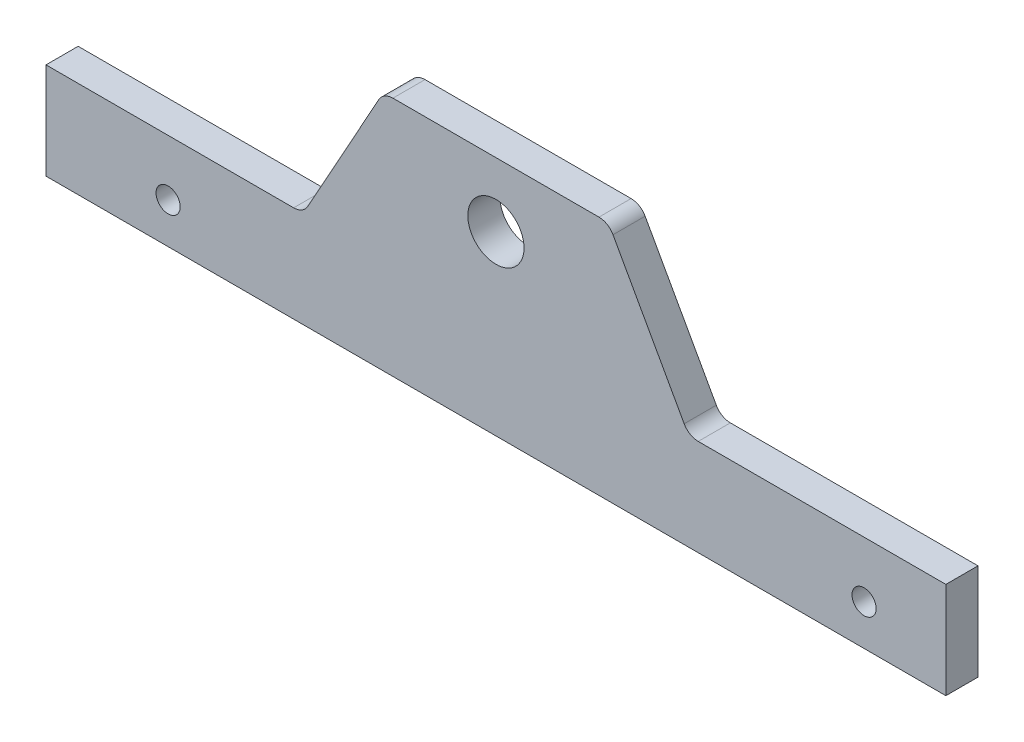
ISO-10303-21;
HEADER;
FILE_DESCRIPTION(('STEP AP214'),'2;1');
FILE_NAME('part.step','',(''),(''),'','','');
FILE_SCHEMA(('AUTOMOTIVE_DESIGN { 1 0 10303 214 1 1 1 1 }'));
ENDSEC;
DATA;
#1=APPLICATION_CONTEXT('core data for automotive mechanical design processes');
#2=APPLICATION_PROTOCOL_DEFINITION('international standard','automotive_design',2000,#1);
#3=PRODUCT_CONTEXT('',#1,'mechanical');
#4=PRODUCT('Part','Part','',(#3));
#5=PRODUCT_RELATED_PRODUCT_CATEGORY('part','',(#4));
#6=PRODUCT_DEFINITION_FORMATION('','',#4);
#7=PRODUCT_DEFINITION_CONTEXT('part definition',#1,'design');
#8=PRODUCT_DEFINITION('design','',#6,#7);
#9=PRODUCT_DEFINITION_SHAPE('','',#8);
#10=(LENGTH_UNIT() NAMED_UNIT(*) SI_UNIT(.MILLI.,.METRE.));
#11=(NAMED_UNIT(*) PLANE_ANGLE_UNIT() SI_UNIT($,.RADIAN.));
#12=(NAMED_UNIT(*) SI_UNIT($,.STERADIAN.) SOLID_ANGLE_UNIT());
#13=UNCERTAINTY_MEASURE_WITH_UNIT(LENGTH_MEASURE(1.E-05),#10,'distance_accuracy_value','');
#14=(GEOMETRIC_REPRESENTATION_CONTEXT(3) GLOBAL_UNCERTAINTY_ASSIGNED_CONTEXT((#13)) GLOBAL_UNIT_ASSIGNED_CONTEXT((#10,
#11,#12)) REPRESENTATION_CONTEXT('',''));
#15=CARTESIAN_POINT('',(0.,0.,0.));
#16=DIRECTION('',(0.,0.,1.));
#17=DIRECTION('',(1.,0.,0.));
#18=AXIS2_PLACEMENT_3D('',#15,#16,#17);
#19=CARTESIAN_POINT('',(39.9681806330704,3.17500000000001,3.175));
#20=DIRECTION('',(0.,0.,1.));
#21=DIRECTION('',(1.,0.,0.));
#22=AXIS2_PLACEMENT_3D('',#19,#20,#21);
#23=PLANE('',#22);
#24=CARTESIAN_POINT('',(72.7456,-11.049,3.175));
#25=DIRECTION('',(0.,0.,1.));
#26=DIRECTION('',(1.,0.,0.));
#27=AXIS2_PLACEMENT_3D('',#24,#25,#26);
#28=CIRCLE('',#27,2.38760000000001);
#29=CARTESIAN_POINT('',(75.1332,-11.049,3.175));
#30=VERTEX_POINT('',#29);
#31=EDGE_CURVE('E279',#30,#30,#28,.T.);
#32=ORIENTED_EDGE('',*,*,#31,.F.);
#33=EDGE_LOOP('',(#32));
#34=FACE_BOUND('',#33,.T.);
#35=CARTESIAN_POINT('',(-64.77,-11.049,3.175));
#36=DIRECTION('',(0.,0.,1.));
#37=DIRECTION('',(1.,0.,0.));
#38=AXIS2_PLACEMENT_3D('',#35,#36,#37);
#39=CIRCLE('',#38,2.38760000000001);
#40=CARTESIAN_POINT('',(-62.3824,-11.049,3.175));
#41=VERTEX_POINT('',#40);
#42=EDGE_CURVE('E281',#41,#41,#39,.T.);
#43=ORIENTED_EDGE('',*,*,#42,.F.);
#44=EDGE_LOOP('',(#43));
#45=FACE_BOUND('',#44,.T.);
#46=DIRECTION('',(0.,-1.,0.));
#47=VECTOR('',#46,1.);
#48=CARTESIAN_POINT('',(-88.9,0.,3.175));
#49=LINE('',#48,#47);
#50=CARTESIAN_POINT('',(-88.9,0.,3.175));
#51=VERTEX_POINT('',#50);
#52=CARTESIAN_POINT('',(-88.9,-19.05,3.175));
#53=VERTEX_POINT('',#52);
#54=EDGE_CURVE('E175',#51,#53,#49,.T.);
#55=ORIENTED_EDGE('',*,*,#54,.T.);
#56=DIRECTION('',(1.,0.,0.));
#57=VECTOR('',#56,1.);
#58=CARTESIAN_POINT('',(-88.9,-19.05,3.175));
#59=LINE('',#58,#57);
#60=CARTESIAN_POINT('',(88.9,-19.05,3.175));
#61=VERTEX_POINT('',#60);
#62=EDGE_CURVE('E103',#53,#61,#59,.T.);
#63=ORIENTED_EDGE('',*,*,#62,.T.);
#64=DIRECTION('',(0.,1.,0.));
#65=VECTOR('',#64,1.);
#66=CARTESIAN_POINT('',(88.9,-19.05,3.175));
#67=LINE('',#66,#65);
#68=CARTESIAN_POINT('',(88.9,0.,3.175));
#69=VERTEX_POINT('',#68);
#70=EDGE_CURVE('E202',#61,#69,#67,.T.);
#71=ORIENTED_EDGE('',*,*,#70,.T.);
#72=DIRECTION('',(-1.,0.,0.));
#73=VECTOR('',#72,1.);
#74=CARTESIAN_POINT('',(88.9,0.,3.175));
#75=LINE('',#74,#73);
#76=CARTESIAN_POINT('',(39.9681806330704,0.,3.175));
#77=VERTEX_POINT('',#76);
#78=EDGE_CURVE('E221',#69,#77,#75,.T.);
#79=ORIENTED_EDGE('',*,*,#78,.T.);
#80=CARTESIAN_POINT('',(39.9681806330704,3.17500000000001,3.175));
#81=DIRECTION('',(0.,0.,-1.));
#82=DIRECTION('',(1.,0.,0.));
#83=AXIS2_PLACEMENT_3D('',#80,#81,#82);
#84=CIRCLE('',#83,3.175);
#85=CARTESIAN_POINT('',(37.1927312813845,1.63308369350787,3.175));
#86=VERTEX_POINT('',#85);
#87=EDGE_CURVE('E218',#77,#86,#84,.T.);
#88=ORIENTED_EDGE('',*,*,#87,.T.);
#89=DIRECTION('',(-0.485642931178632,0.874157276121538,0.));
#90=VECTOR('',#89,1.);
#91=CARTESIAN_POINT('',(37.1927312813845,1.63308369350787,3.175));
#92=LINE('',#91,#90);
#93=CARTESIAN_POINT('',(23.1322687186155,26.9419163064921,3.175));
#94=VERTEX_POINT('',#93);
#95=EDGE_CURVE('E220',#86,#94,#92,.T.);
#96=ORIENTED_EDGE('',*,*,#95,.T.);
#97=CARTESIAN_POINT('',(20.3568193669296,25.4,3.175));
#98=DIRECTION('',(0.,0.,1.));
#99=DIRECTION('',(1.,0.,0.));
#100=AXIS2_PLACEMENT_3D('',#97,#98,#99);
#101=CIRCLE('',#100,3.175);
#102=CARTESIAN_POINT('',(20.3568193669296,28.575,3.175));
#103=VERTEX_POINT('',#102);
#104=EDGE_CURVE('E223',#94,#103,#101,.T.);
#105=ORIENTED_EDGE('',*,*,#104,.T.);
#106=DIRECTION('',(-1.,0.,0.));
#107=VECTOR('',#106,1.);
#108=CARTESIAN_POINT('',(-20.3568193669296,28.575,3.175));
#109=LINE('',#108,#107);
#110=CARTESIAN_POINT('',(-20.3568193669296,28.575,3.175));
#111=VERTEX_POINT('',#110);
#112=EDGE_CURVE('E229',#103,#111,#109,.T.);
#113=ORIENTED_EDGE('',*,*,#112,.T.);
#114=CARTESIAN_POINT('',(-20.3568193669296,25.4,3.175));
#115=DIRECTION('',(0.,0.,1.));
#116=DIRECTION('',(-1.,0.,0.));
#117=AXIS2_PLACEMENT_3D('',#114,#115,#116);
#118=CIRCLE('',#117,3.175);
#119=CARTESIAN_POINT('',(-23.1322687186155,26.9419163064921,3.175));
#120=VERTEX_POINT('',#119);
#121=EDGE_CURVE('E134',#111,#120,#118,.T.);
#122=ORIENTED_EDGE('',*,*,#121,.T.);
#123=DIRECTION('',(-0.485642931178632,-0.874157276121538,0.));
#124=VECTOR('',#123,1.);
#125=CARTESIAN_POINT('',(-37.1927312813845,1.63308369350786,3.175));
#126=LINE('',#125,#124);
#127=CARTESIAN_POINT('',(-37.1927312813845,1.63308369350786,3.175));
#128=VERTEX_POINT('',#127);
#129=EDGE_CURVE('E128',#120,#128,#126,.T.);
#130=ORIENTED_EDGE('',*,*,#129,.T.);
#131=CARTESIAN_POINT('',(-39.9681806330704,3.175,3.175));
#132=DIRECTION('',(0.,0.,-1.));
#133=DIRECTION('',(1.,0.,0.));
#134=AXIS2_PLACEMENT_3D('',#131,#132,#133);
#135=CIRCLE('',#134,3.175);
#136=CARTESIAN_POINT('',(-39.9681806330704,0.,3.175));
#137=VERTEX_POINT('',#136);
#138=EDGE_CURVE('E132',#128,#137,#135,.T.);
#139=ORIENTED_EDGE('',*,*,#138,.T.);
#140=DIRECTION('',(-1.,0.,0.));
#141=VECTOR('',#140,1.);
#142=CARTESIAN_POINT('',(-88.9,0.,3.175));
#143=LINE('',#142,#141);
#144=EDGE_CURVE('E48',#137,#51,#143,.T.);
#145=ORIENTED_EDGE('',*,*,#144,.T.);
#146=EDGE_LOOP('',(#55,#63,#71,#79,#88,#96,#105,#113,#122,#130,#139,#145));
#147=FACE_BOUND('',#146,.T.);
#148=CARTESIAN_POINT('',(0.,15.875,3.175));
#149=DIRECTION('',(0.,0.,1.));
#150=DIRECTION('',(1.,0.,0.));
#151=AXIS2_PLACEMENT_3D('',#148,#149,#150);
#152=CIRCLE('',#151,5.55625);
#153=CARTESIAN_POINT('',(5.55625,15.875,3.175));
#154=VERTEX_POINT('',#153);
#155=EDGE_CURVE('E156',#154,#154,#152,.T.);
#156=ORIENTED_EDGE('',*,*,#155,.F.);
#157=EDGE_LOOP('',(#156));
#158=FACE_BOUND('',#157,.T.);
#159=ADVANCED_FACE('F31',(#34,#45,#147,#158),#23,.T.);
#160=CARTESIAN_POINT('',(39.9681806330704,3.17500000000001,-3.175));
#161=DIRECTION('',(0.,0.,1.));
#162=DIRECTION('',(1.,0.,0.));
#163=AXIS2_PLACEMENT_3D('',#160,#161,#162);
#164=PLANE('',#163);
#165=CARTESIAN_POINT('',(72.7456,-11.049,-3.175));
#166=DIRECTION('',(0.,0.,1.));
#167=DIRECTION('',(1.,0.,0.));
#168=AXIS2_PLACEMENT_3D('',#165,#166,#167);
#169=CIRCLE('',#168,2.38760000000001);
#170=CARTESIAN_POINT('',(75.1332,-11.049,-3.175));
#171=VERTEX_POINT('',#170);
#172=EDGE_CURVE('E277',#171,#171,#169,.T.);
#173=ORIENTED_EDGE('',*,*,#172,.T.);
#174=EDGE_LOOP('',(#173));
#175=FACE_BOUND('',#174,.T.);
#176=CARTESIAN_POINT('',(-64.77,-11.049,-3.175));
#177=DIRECTION('',(0.,0.,1.));
#178=DIRECTION('',(1.,0.,0.));
#179=AXIS2_PLACEMENT_3D('',#176,#177,#178);
#180=CIRCLE('',#179,2.38760000000001);
#181=CARTESIAN_POINT('',(-62.3824,-11.049,-3.175));
#182=VERTEX_POINT('',#181);
#183=EDGE_CURVE('E284',#182,#182,#180,.T.);
#184=ORIENTED_EDGE('',*,*,#183,.T.);
#185=EDGE_LOOP('',(#184));
#186=FACE_BOUND('',#185,.T.);
#187=DIRECTION('',(0.,-1.,0.));
#188=VECTOR('',#187,1.);
#189=CARTESIAN_POINT('',(-88.9,0.,-3.175));
#190=LINE('',#189,#188);
#191=CARTESIAN_POINT('',(-88.9,0.,-3.175));
#192=VERTEX_POINT('',#191);
#193=CARTESIAN_POINT('',(-88.9,-19.05,-3.175));
#194=VERTEX_POINT('',#193);
#195=EDGE_CURVE('E152',#192,#194,#190,.T.);
#196=ORIENTED_EDGE('',*,*,#195,.F.);
#197=DIRECTION('',(-1.,0.,0.));
#198=VECTOR('',#197,1.);
#199=CARTESIAN_POINT('',(-88.9,0.,-3.175));
#200=LINE('',#199,#198);
#201=CARTESIAN_POINT('',(-39.9681806330704,0.,-3.175));
#202=VERTEX_POINT('',#201);
#203=EDGE_CURVE('E95',#202,#192,#200,.T.);
#204=ORIENTED_EDGE('',*,*,#203,.F.);
#205=CARTESIAN_POINT('',(-39.9681806330704,3.175,-3.175));
#206=DIRECTION('',(0.,0.,-1.));
#207=DIRECTION('',(1.,0.,0.));
#208=AXIS2_PLACEMENT_3D('',#205,#206,#207);
#209=CIRCLE('',#208,3.175);
#210=CARTESIAN_POINT('',(-37.1927312813845,1.63308369350786,-3.175));
#211=VERTEX_POINT('',#210);
#212=EDGE_CURVE('E89',#211,#202,#209,.T.);
#213=ORIENTED_EDGE('',*,*,#212,.F.);
#214=DIRECTION('',(-0.485642931178632,-0.874157276121538,0.));
#215=VECTOR('',#214,1.);
#216=CARTESIAN_POINT('',(-37.1927312813845,1.63308369350786,-3.175));
#217=LINE('',#216,#215);
#218=CARTESIAN_POINT('',(-23.1322687186155,26.9419163064921,-3.175));
#219=VERTEX_POINT('',#218);
#220=EDGE_CURVE('E142',#219,#211,#217,.T.);
#221=ORIENTED_EDGE('',*,*,#220,.F.);
#222=CARTESIAN_POINT('',(-20.3568193669296,25.4,-3.175));
#223=DIRECTION('',(0.,0.,1.));
#224=DIRECTION('',(-1.,0.,0.));
#225=AXIS2_PLACEMENT_3D('',#222,#223,#224);
#226=CIRCLE('',#225,3.175);
#227=CARTESIAN_POINT('',(-20.3568193669296,28.575,-3.175));
#228=VERTEX_POINT('',#227);
#229=EDGE_CURVE('E170',#228,#219,#226,.T.);
#230=ORIENTED_EDGE('',*,*,#229,.F.);
#231=DIRECTION('',(-1.,0.,0.));
#232=VECTOR('',#231,1.);
#233=CARTESIAN_POINT('',(-20.3568193669296,28.575,-3.175));
#234=LINE('',#233,#232);
#235=CARTESIAN_POINT('',(20.3568193669296,28.575,-3.175));
#236=VERTEX_POINT('',#235);
#237=EDGE_CURVE('E168',#236,#228,#234,.T.);
#238=ORIENTED_EDGE('',*,*,#237,.F.);
#239=CARTESIAN_POINT('',(20.3568193669296,25.4,-3.175));
#240=DIRECTION('',(0.,0.,1.));
#241=DIRECTION('',(1.,0.,0.));
#242=AXIS2_PLACEMENT_3D('',#239,#240,#241);
#243=CIRCLE('',#242,3.175);
#244=CARTESIAN_POINT('',(23.1322687186155,26.9419163064921,-3.175));
#245=VERTEX_POINT('',#244);
#246=EDGE_CURVE('E166',#245,#236,#243,.T.);
#247=ORIENTED_EDGE('',*,*,#246,.F.);
#248=DIRECTION('',(-0.485642931178632,0.874157276121538,0.));
#249=VECTOR('',#248,1.);
#250=CARTESIAN_POINT('',(37.1927312813845,1.63308369350787,-3.175));
#251=LINE('',#250,#249);
#252=CARTESIAN_POINT('',(37.1927312813845,1.63308369350787,-3.175));
#253=VERTEX_POINT('',#252);
#254=EDGE_CURVE('E164',#253,#245,#251,.T.);
#255=ORIENTED_EDGE('',*,*,#254,.F.);
#256=CARTESIAN_POINT('',(39.9681806330704,3.17500000000001,-3.175));
#257=DIRECTION('',(0.,0.,-1.));
#258=DIRECTION('',(1.,0.,0.));
#259=AXIS2_PLACEMENT_3D('',#256,#257,#258);
#260=CIRCLE('',#259,3.175);
#261=CARTESIAN_POINT('',(39.9681806330704,0.,-3.175));
#262=VERTEX_POINT('',#261);
#263=EDGE_CURVE('E162',#262,#253,#260,.T.);
#264=ORIENTED_EDGE('',*,*,#263,.F.);
#265=DIRECTION('',(-1.,0.,0.));
#266=VECTOR('',#265,1.);
#267=CARTESIAN_POINT('',(88.9,0.,-3.175));
#268=LINE('',#267,#266);
#269=CARTESIAN_POINT('',(88.9,0.,-3.175));
#270=VERTEX_POINT('',#269);
#271=EDGE_CURVE('E160',#270,#262,#268,.T.);
#272=ORIENTED_EDGE('',*,*,#271,.F.);
#273=DIRECTION('',(0.,1.,0.));
#274=VECTOR('',#273,1.);
#275=CARTESIAN_POINT('',(88.9,-19.05,-3.175));
#276=LINE('',#275,#274);
#277=CARTESIAN_POINT('',(88.9,-19.05,-3.175));
#278=VERTEX_POINT('',#277);
#279=EDGE_CURVE('E158',#278,#270,#276,.T.);
#280=ORIENTED_EDGE('',*,*,#279,.F.);
#281=DIRECTION('',(1.,0.,0.));
#282=VECTOR('',#281,1.);
#283=CARTESIAN_POINT('',(-88.9,-19.05,-3.175));
#284=LINE('',#283,#282);
#285=EDGE_CURVE('E155',#194,#278,#284,.T.);
#286=ORIENTED_EDGE('',*,*,#285,.F.);
#287=EDGE_LOOP('',(#196,#204,#213,#221,#230,#238,#247,#255,#264,#272,#280,#286));
#288=FACE_BOUND('',#287,.T.);
#289=CARTESIAN_POINT('',(0.,15.875,-3.175));
#290=DIRECTION('',(0.,0.,1.));
#291=DIRECTION('',(1.,0.,0.));
#292=AXIS2_PLACEMENT_3D('',#289,#290,#291);
#293=CIRCLE('',#292,5.55625);
#294=CARTESIAN_POINT('',(5.55625,15.875,-3.175));
#295=VERTEX_POINT('',#294);
#296=EDGE_CURVE('E287',#295,#295,#293,.T.);
#297=ORIENTED_EDGE('',*,*,#296,.T.);
#298=EDGE_LOOP('',(#297));
#299=FACE_BOUND('',#298,.T.);
#300=ADVANCED_FACE('F206',(#175,#186,#288,#299),#164,.F.);
#301=CARTESIAN_POINT('',(-88.9,0.,3.175));
#302=DIRECTION('',(1.,0.,0.));
#303=DIRECTION('',(0.,0.,-1.));
#304=AXIS2_PLACEMENT_3D('',#301,#302,#303);
#305=PLANE('',#304);
#306=ORIENTED_EDGE('',*,*,#195,.T.);
#307=DIRECTION('',(0.,0.,-1.));
#308=VECTOR('',#307,1.);
#309=CARTESIAN_POINT('',(-88.9,-19.05,3.175));
#310=LINE('',#309,#308);
#311=EDGE_CURVE('E11',#53,#194,#310,.T.);
#312=ORIENTED_EDGE('',*,*,#311,.F.);
#313=ORIENTED_EDGE('',*,*,#54,.F.);
#314=DIRECTION('',(0.,0.,-1.));
#315=VECTOR('',#314,1.);
#316=CARTESIAN_POINT('',(-88.9,0.,3.175));
#317=LINE('',#316,#315);
#318=EDGE_CURVE('E148',#51,#192,#317,.T.);
#319=ORIENTED_EDGE('',*,*,#318,.T.);
#320=EDGE_LOOP('',(#306,#312,#313,#319));
#321=FACE_BOUND('',#320,.T.);
#322=ADVANCED_FACE('F33',(#321),#305,.F.);
#323=CARTESIAN_POINT('',(-88.9,-19.05,3.175));
#324=DIRECTION('',(0.,1.,0.));
#325=DIRECTION('',(-1.,0.,0.));
#326=AXIS2_PLACEMENT_3D('',#323,#324,#325);
#327=PLANE('',#326);
#328=ORIENTED_EDGE('',*,*,#285,.T.);
#329=DIRECTION('',(0.,0.,-1.));
#330=VECTOR('',#329,1.);
#331=CARTESIAN_POINT('',(88.9,-19.05,3.175));
#332=LINE('',#331,#330);
#333=EDGE_CURVE('E40',#61,#278,#332,.T.);
#334=ORIENTED_EDGE('',*,*,#333,.F.);
#335=ORIENTED_EDGE('',*,*,#62,.F.);
#336=ORIENTED_EDGE('',*,*,#311,.T.);
#337=EDGE_LOOP('',(#328,#334,#335,#336));
#338=FACE_BOUND('',#337,.T.);
#339=ADVANCED_FACE('F332',(#338),#327,.F.);
#340=CARTESIAN_POINT('',(88.9,-19.05,3.175));
#341=DIRECTION('',(-1.,0.,0.));
#342=DIRECTION('',(0.,0.,1.));
#343=AXIS2_PLACEMENT_3D('',#340,#341,#342);
#344=PLANE('',#343);
#345=ORIENTED_EDGE('',*,*,#279,.T.);
#346=DIRECTION('',(0.,0.,-1.));
#347=VECTOR('',#346,1.);
#348=CARTESIAN_POINT('',(88.9,0.,3.175));
#349=LINE('',#348,#347);
#350=EDGE_CURVE('E194',#69,#270,#349,.T.);
#351=ORIENTED_EDGE('',*,*,#350,.F.);
#352=ORIENTED_EDGE('',*,*,#70,.F.);
#353=ORIENTED_EDGE('',*,*,#333,.T.);
#354=EDGE_LOOP('',(#345,#351,#352,#353));
#355=FACE_BOUND('',#354,.T.);
#356=ADVANCED_FACE('F200',(#355),#344,.F.);
#357=CARTESIAN_POINT('',(88.9,0.,3.175));
#358=DIRECTION('',(0.,-1.,0.));
#359=DIRECTION('',(1.,0.,0.));
#360=AXIS2_PLACEMENT_3D('',#357,#358,#359);
#361=PLANE('',#360);
#362=ORIENTED_EDGE('',*,*,#271,.T.);
#363=DIRECTION('',(0.,0.,-1.));
#364=VECTOR('',#363,1.);
#365=CARTESIAN_POINT('',(39.9681806330704,0.,3.175));
#366=LINE('',#365,#364);
#367=EDGE_CURVE('E191',#77,#262,#366,.T.);
#368=ORIENTED_EDGE('',*,*,#367,.F.);
#369=ORIENTED_EDGE('',*,*,#78,.F.);
#370=ORIENTED_EDGE('',*,*,#350,.T.);
#371=EDGE_LOOP('',(#362,#368,#369,#370));
#372=FACE_BOUND('',#371,.T.);
#373=ADVANCED_FACE('F212',(#372),#361,.F.);
#374=CARTESIAN_POINT('',(39.9681806330704,3.17500000000001,3.175));
#375=DIRECTION('',(0.,0.,-1.));
#376=DIRECTION('',(-1.,0.,0.));
#377=AXIS2_PLACEMENT_3D('',#374,#375,#376);
#378=CYLINDRICAL_SURFACE('',#377,3.175);
#379=ORIENTED_EDGE('',*,*,#263,.T.);
#380=DIRECTION('',(0.,0.,-1.));
#381=VECTOR('',#380,1.);
#382=CARTESIAN_POINT('',(37.1927312813845,1.63308369350787,3.175));
#383=LINE('',#382,#381);
#384=EDGE_CURVE('E188',#86,#253,#383,.T.);
#385=ORIENTED_EDGE('',*,*,#384,.F.);
#386=ORIENTED_EDGE('',*,*,#87,.F.);
#387=ORIENTED_EDGE('',*,*,#367,.T.);
#388=EDGE_LOOP('',(#379,#385,#386,#387));
#389=FACE_BOUND('',#388,.T.);
#390=ADVANCED_FACE('F216',(#389),#378,.F.);
#391=CARTESIAN_POINT('',(37.1927312813845,1.63308369350787,3.175));
#392=DIRECTION('',(-0.874157276121537,-0.485642931178632,0.));
#393=DIRECTION('',(0.485642931178632,-0.874157276121538,0.));
#394=AXIS2_PLACEMENT_3D('',#391,#392,#393);
#395=PLANE('',#394);
#396=ORIENTED_EDGE('',*,*,#254,.T.);
#397=DIRECTION('',(0.,0.,-1.));
#398=VECTOR('',#397,1.);
#399=CARTESIAN_POINT('',(23.1322687186155,26.9419163064921,3.175));
#400=LINE('',#399,#398);
#401=EDGE_CURVE('E185',#94,#245,#400,.T.);
#402=ORIENTED_EDGE('',*,*,#401,.F.);
#403=ORIENTED_EDGE('',*,*,#95,.F.);
#404=ORIENTED_EDGE('',*,*,#384,.T.);
#405=EDGE_LOOP('',(#396,#402,#403,#404));
#406=FACE_BOUND('',#405,.T.);
#407=ADVANCED_FACE('F354',(#406),#395,.F.);
#408=CARTESIAN_POINT('',(20.3568193669296,25.4,3.175));
#409=DIRECTION('',(0.,0.,-1.));
#410=DIRECTION('',(-1.,0.,0.));
#411=AXIS2_PLACEMENT_3D('',#408,#409,#410);
#412=CYLINDRICAL_SURFACE('',#411,3.175);
#413=ORIENTED_EDGE('',*,*,#246,.T.);
#414=DIRECTION('',(0.,0.,-1.));
#415=VECTOR('',#414,1.);
#416=CARTESIAN_POINT('',(20.3568193669296,28.575,3.175));
#417=LINE('',#416,#415);
#418=EDGE_CURVE('E182',#103,#236,#417,.T.);
#419=ORIENTED_EDGE('',*,*,#418,.F.);
#420=ORIENTED_EDGE('',*,*,#104,.F.);
#421=ORIENTED_EDGE('',*,*,#401,.T.);
#422=EDGE_LOOP('',(#413,#419,#420,#421));
#423=FACE_BOUND('',#422,.T.);
#424=ADVANCED_FACE('F361',(#423),#412,.T.);
#425=CARTESIAN_POINT('',(-20.3568193669296,28.575,3.175));
#426=DIRECTION('',(0.,-1.,0.));
#427=DIRECTION('',(1.,0.,0.));
#428=AXIS2_PLACEMENT_3D('',#425,#426,#427);
#429=PLANE('',#428);
#430=ORIENTED_EDGE('',*,*,#237,.T.);
#431=DIRECTION('',(0.,0.,-1.));
#432=VECTOR('',#431,1.);
#433=CARTESIAN_POINT('',(-20.3568193669296,28.575,3.175));
#434=LINE('',#433,#432);
#435=EDGE_CURVE('E179',#111,#228,#434,.T.);
#436=ORIENTED_EDGE('',*,*,#435,.F.);
#437=ORIENTED_EDGE('',*,*,#112,.F.);
#438=ORIENTED_EDGE('',*,*,#418,.T.);
#439=EDGE_LOOP('',(#430,#436,#437,#438));
#440=FACE_BOUND('',#439,.T.);
#441=ADVANCED_FACE('F235',(#440),#429,.F.);
#442=CARTESIAN_POINT('',(-20.3568193669296,25.4,3.175));
#443=DIRECTION('',(0.,0.,-1.));
#444=DIRECTION('',(-1.,0.,0.));
#445=AXIS2_PLACEMENT_3D('',#442,#443,#444);
#446=CYLINDRICAL_SURFACE('',#445,3.175);
#447=ORIENTED_EDGE('',*,*,#229,.T.);
#448=DIRECTION('',(0.,0.,-1.));
#449=VECTOR('',#448,1.);
#450=CARTESIAN_POINT('',(-23.1322687186155,26.9419163064921,3.175));
#451=LINE('',#450,#449);
#452=EDGE_CURVE('E143',#120,#219,#451,.T.);
#453=ORIENTED_EDGE('',*,*,#452,.F.);
#454=ORIENTED_EDGE('',*,*,#121,.F.);
#455=ORIENTED_EDGE('',*,*,#435,.T.);
#456=EDGE_LOOP('',(#447,#453,#454,#455));
#457=FACE_BOUND('',#456,.T.);
#458=ADVANCED_FACE('F239',(#457),#446,.T.);
#459=CARTESIAN_POINT('',(-37.1927312813845,1.63308369350786,3.175));
#460=DIRECTION('',(0.874157276121537,-0.485642931178632,0.));
#461=DIRECTION('',(0.485642931178632,0.874157276121538,0.));
#462=AXIS2_PLACEMENT_3D('',#459,#460,#461);
#463=PLANE('',#462);
#464=ORIENTED_EDGE('',*,*,#220,.T.);
#465=DIRECTION('',(0.,0.,-1.));
#466=VECTOR('',#465,1.);
#467=CARTESIAN_POINT('',(-37.1927312813845,1.63308369350786,3.175));
#468=LINE('',#467,#466);
#469=EDGE_CURVE('E139',#128,#211,#468,.T.);
#470=ORIENTED_EDGE('',*,*,#469,.F.);
#471=ORIENTED_EDGE('',*,*,#129,.F.);
#472=ORIENTED_EDGE('',*,*,#452,.T.);
#473=EDGE_LOOP('',(#464,#470,#471,#472));
#474=FACE_BOUND('',#473,.T.);
#475=ADVANCED_FACE('F140',(#474),#463,.F.);
#476=CARTESIAN_POINT('',(-39.9681806330704,3.175,3.175));
#477=DIRECTION('',(0.,0.,-1.));
#478=DIRECTION('',(-1.,0.,0.));
#479=AXIS2_PLACEMENT_3D('',#476,#477,#478);
#480=CYLINDRICAL_SURFACE('',#479,3.175);
#481=ORIENTED_EDGE('',*,*,#212,.T.);
#482=DIRECTION('',(0.,0.,-1.));
#483=VECTOR('',#482,1.);
#484=CARTESIAN_POINT('',(-39.9681806330704,0.,3.175));
#485=LINE('',#484,#483);
#486=EDGE_CURVE('E144',#137,#202,#485,.T.);
#487=ORIENTED_EDGE('',*,*,#486,.F.);
#488=ORIENTED_EDGE('',*,*,#138,.F.);
#489=ORIENTED_EDGE('',*,*,#469,.T.);
#490=EDGE_LOOP('',(#481,#487,#488,#489));
#491=FACE_BOUND('',#490,.T.);
#492=ADVANCED_FACE('F146',(#491),#480,.F.);
#493=CARTESIAN_POINT('',(-88.9,0.,3.175));
#494=DIRECTION('',(0.,-1.,0.));
#495=DIRECTION('',(0.,0.,-1.));
#496=AXIS2_PLACEMENT_3D('',#493,#494,#495);
#497=PLANE('',#496);
#498=ORIENTED_EDGE('',*,*,#203,.T.);
#499=ORIENTED_EDGE('',*,*,#318,.F.);
#500=ORIENTED_EDGE('',*,*,#144,.F.);
#501=ORIENTED_EDGE('',*,*,#486,.T.);
#502=EDGE_LOOP('',(#498,#499,#500,#501));
#503=FACE_BOUND('',#502,.T.);
#504=ADVANCED_FACE('F243',(#503),#497,.F.);
#505=CARTESIAN_POINT('',(0.,15.875,3.175));
#506=DIRECTION('',(0.,0.,-1.));
#507=DIRECTION('',(-1.,0.,0.));
#508=AXIS2_PLACEMENT_3D('',#505,#506,#507);
#509=CYLINDRICAL_SURFACE('',#508,5.55625);
#510=ORIENTED_EDGE('',*,*,#155,.T.);
#511=EDGE_LOOP('',(#510));
#512=FACE_BOUND('',#511,.T.);
#513=ORIENTED_EDGE('',*,*,#296,.F.);
#514=EDGE_LOOP('',(#513));
#515=FACE_BOUND('',#514,.T.);
#516=ADVANCED_FACE('F245',(#512,#515),#509,.F.);
#517=CARTESIAN_POINT('',(-64.77,-11.049,-3.175));
#518=DIRECTION('',(0.,0.,1.));
#519=DIRECTION('',(1.,0.,0.));
#520=AXIS2_PLACEMENT_3D('',#517,#518,#519);
#521=CYLINDRICAL_SURFACE('',#520,2.38760000000001);
#522=ORIENTED_EDGE('',*,*,#183,.F.);
#523=EDGE_LOOP('',(#522));
#524=FACE_BOUND('',#523,.T.);
#525=ORIENTED_EDGE('',*,*,#42,.T.);
#526=EDGE_LOOP('',(#525));
#527=FACE_BOUND('',#526,.T.);
#528=ADVANCED_FACE('F251',(#524,#527),#521,.F.);
#529=CARTESIAN_POINT('',(72.7456,-11.049,-3.175));
#530=DIRECTION('',(0.,0.,1.));
#531=DIRECTION('',(1.,0.,0.));
#532=AXIS2_PLACEMENT_3D('',#529,#530,#531);
#533=CYLINDRICAL_SURFACE('',#532,2.38760000000001);
#534=ORIENTED_EDGE('',*,*,#172,.F.);
#535=EDGE_LOOP('',(#534));
#536=FACE_BOUND('',#535,.T.);
#537=ORIENTED_EDGE('',*,*,#31,.T.);
#538=EDGE_LOOP('',(#537));
#539=FACE_BOUND('',#538,.T.);
#540=ADVANCED_FACE('F268',(#536,#539),#533,.F.);
#541=CLOSED_SHELL('',(#159,#300,#322,#339,#356,#373,#390,#407,#424,#441,#458,#475,#492,#504,
#516,#528,#540));
#542=MANIFOLD_SOLID_BREP('B2',#541);
#543=ADVANCED_BREP_SHAPE_REPRESENTATION('',(#18,#542),#14);
#544=SHAPE_DEFINITION_REPRESENTATION(#9,#543);
ENDSEC;
END-ISO-10303-21;
